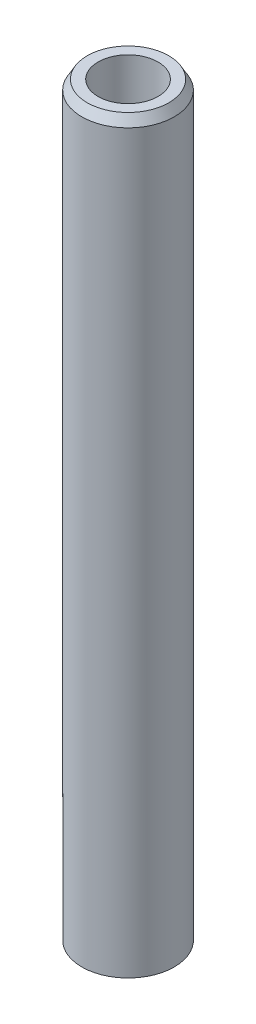
ISO-10303-21;
HEADER;
FILE_DESCRIPTION(('STEP AP214'),'2;1');
FILE_NAME('part.step','',(''),(''),'','','');
FILE_SCHEMA(('AUTOMOTIVE_DESIGN { 1 0 10303 214 1 1 1 1 }'));
ENDSEC;
DATA;
#1=APPLICATION_CONTEXT('core data for automotive mechanical design processes');
#2=APPLICATION_PROTOCOL_DEFINITION('international standard','automotive_design',2000,#1);
#3=PRODUCT_CONTEXT('',#1,'mechanical');
#4=PRODUCT('Part','Part','',(#3));
#5=PRODUCT_RELATED_PRODUCT_CATEGORY('part','',(#4));
#6=PRODUCT_DEFINITION_FORMATION('','',#4);
#7=PRODUCT_DEFINITION_CONTEXT('part definition',#1,'design');
#8=PRODUCT_DEFINITION('design','',#6,#7);
#9=PRODUCT_DEFINITION_SHAPE('','',#8);
#10=(LENGTH_UNIT() NAMED_UNIT(*) SI_UNIT(.MILLI.,.METRE.));
#11=(NAMED_UNIT(*) PLANE_ANGLE_UNIT() SI_UNIT($,.RADIAN.));
#12=(NAMED_UNIT(*) SI_UNIT($,.STERADIAN.) SOLID_ANGLE_UNIT());
#13=UNCERTAINTY_MEASURE_WITH_UNIT(LENGTH_MEASURE(1.E-05),#10,'distance_accuracy_value','');
#14=(GEOMETRIC_REPRESENTATION_CONTEXT(3) GLOBAL_UNCERTAINTY_ASSIGNED_CONTEXT((#13)) GLOBAL_UNIT_ASSIGNED_CONTEXT((#10,
#11,#12)) REPRESENTATION_CONTEXT('',''));
#15=CARTESIAN_POINT('',(0.,0.,0.));
#16=DIRECTION('',(0.,0.,1.));
#17=DIRECTION('',(1.,0.,0.));
#18=AXIS2_PLACEMENT_3D('',#15,#16,#17);
#19=CARTESIAN_POINT('',(0.,243.727219641702,0.));
#20=DIRECTION('',(0.,-1.,0.));
#21=DIRECTION('',(0.,0.,-1.));
#22=AXIS2_PLACEMENT_3D('',#19,#20,#21);
#23=CYLINDRICAL_SURFACE('',#22,15.);
#24=CARTESIAN_POINT('',(0.,240.657204855873,0.));
#25=DIRECTION('',(0.,1.,0.));
#26=DIRECTION('',(0.,0.,1.));
#27=AXIS2_PLACEMENT_3D('',#24,#25,#26);
#28=CIRCLE('',#27,15.);
#29=CARTESIAN_POINT('',(0.,240.657204855873,-15.));
#30=VERTEX_POINT('',#29);
#31=EDGE_CURVE('E50',#30,#30,#28,.F.);
#32=CARTESIAN_POINT('',(0.,1.7724738630143,0.));
#33=DIRECTION('',(0.,1.,0.));
#34=DIRECTION('',(0.,0.,1.));
#35=AXIS2_PLACEMENT_3D('',#32,#33,#34);
#36=CIRCLE('',#35,15.);
#37=CARTESIAN_POINT('',(0.,1.77247386301427,-15.));
#38=VERTEX_POINT('',#37);
#39=EDGE_CURVE('E51',#38,#38,#36,.T.);
#40=CARTESIAN_POINT('',(0.,240.657204855873,-15.));
#41=CARTESIAN_POINT('',(0.,238.168822241364,-15.));
#42=CARTESIAN_POINT('',(0.,235.680439626855,-15.));
#43=CARTESIAN_POINT('',(0.,230.703674397837,-15.));
#44=CARTESIAN_POINT('',(0.,228.215291783329,-15.));
#45=CARTESIAN_POINT('',(0.,223.238526554311,-15.));
#46=CARTESIAN_POINT('',(0.,220.750143939802,-15.));
#47=CARTESIAN_POINT('',(0.,215.773378710784,-15.));
#48=CARTESIAN_POINT('',(0.,213.284996096275,-15.));
#49=CARTESIAN_POINT('',(0.,208.308230867257,-15.));
#50=CARTESIAN_POINT('',(0.,205.819848252748,-15.));
#51=CARTESIAN_POINT('',(0.,200.84308302373,-15.));
#52=CARTESIAN_POINT('',(0.,198.354700409221,-15.));
#53=CARTESIAN_POINT('',(0.,193.377935180203,-15.));
#54=CARTESIAN_POINT('',(0.,190.889552565694,-15.));
#55=CARTESIAN_POINT('',(0.,185.912787336676,-15.));
#56=CARTESIAN_POINT('',(0.,183.424404722167,-15.));
#57=CARTESIAN_POINT('',(0.,178.44763949315,-15.));
#58=CARTESIAN_POINT('',(0.,175.959256878641,-15.));
#59=CARTESIAN_POINT('',(0.,170.982491649623,-15.));
#60=CARTESIAN_POINT('',(0.,168.494109035114,-15.));
#61=CARTESIAN_POINT('',(0.,163.517343806096,-15.));
#62=CARTESIAN_POINT('',(0.,161.028961191587,-15.));
#63=CARTESIAN_POINT('',(0.,156.052195962569,-15.));
#64=CARTESIAN_POINT('',(0.,153.56381334806,-15.));
#65=CARTESIAN_POINT('',(0.,148.587048119042,-15.));
#66=CARTESIAN_POINT('',(0.,146.098665504533,-15.));
#67=CARTESIAN_POINT('',(0.,141.121900275515,-15.));
#68=CARTESIAN_POINT('',(0.,138.633517661006,-15.));
#69=CARTESIAN_POINT('',(0.,133.656752431988,-15.));
#70=CARTESIAN_POINT('',(0.,131.16836981748,-15.));
#71=CARTESIAN_POINT('',(0.,126.191604588462,-15.));
#72=CARTESIAN_POINT('',(0.,123.703221973953,-15.));
#73=CARTESIAN_POINT('',(0.,118.726456744935,-15.));
#74=CARTESIAN_POINT('',(0.,116.238074130426,-15.));
#75=CARTESIAN_POINT('',(0.,111.261308901408,-15.));
#76=CARTESIAN_POINT('',(0.,108.772926286899,-15.));
#77=CARTESIAN_POINT('',(0.,103.796161057881,-15.));
#78=CARTESIAN_POINT('',(0.,101.307778443372,-15.));
#79=CARTESIAN_POINT('',(0.,96.3310132143543,-15.));
#80=CARTESIAN_POINT('',(0.,93.8426305998453,-15.));
#81=CARTESIAN_POINT('',(0.,88.8658653708274,-15.));
#82=CARTESIAN_POINT('',(0.,86.3774827563185,-15.));
#83=CARTESIAN_POINT('',(0.,81.4007175273006,-15.));
#84=CARTESIAN_POINT('',(0.,78.9123349127916,-15.));
#85=CARTESIAN_POINT('',(0.,73.9355696837737,-15.));
#86=CARTESIAN_POINT('',(0.,71.4471870692648,-15.));
#87=CARTESIAN_POINT('',(0.,66.4704218402469,-15.));
#88=CARTESIAN_POINT('',(0.,63.982039225738,-15.));
#89=CARTESIAN_POINT('',(0.,59.0052739967201,-15.));
#90=CARTESIAN_POINT('',(0.,56.5168913822111,-15.));
#91=CARTESIAN_POINT('',(0.,51.5401261531932,-15.));
#92=CARTESIAN_POINT('',(0.,49.0517435386843,-15.));
#93=CARTESIAN_POINT('',(0.,44.0749783096664,-15.));
#94=CARTESIAN_POINT('',(0.,41.5865956951574,-15.));
#95=CARTESIAN_POINT('',(0.,36.6098304661395,-15.));
#96=CARTESIAN_POINT('',(0.,34.1214478516306,-15.));
#97=CARTESIAN_POINT('',(0.,29.1446826226127,-15.));
#98=CARTESIAN_POINT('',(0.,26.6563000081038,-15.));
#99=CARTESIAN_POINT('',(0.,21.6795347790859,-15.));
#100=CARTESIAN_POINT('',(0.,19.1911521645769,-15.));
#101=CARTESIAN_POINT('',(0.,14.214386935559,-15.));
#102=CARTESIAN_POINT('',(0.,11.7260043210501,-15.));
#103=CARTESIAN_POINT('',(0.,6.74923909203216,-15.));
#104=CARTESIAN_POINT('',(0.,4.26085647752321,-15.));
#105=CARTESIAN_POINT('',(0.,1.77247386301427,-15.));
#106=B_SPLINE_CURVE_WITH_KNOTS('',3,(#40,#41,#42,#43,#44,#45,#46,#47,#48,#49,#50,#51,#52,#53,
#54,#55,#56,#57,#58,#59,#60,#61,#62,#63,#64,#65,#66,#67,#68,#69,#70,#71,#72,#73,#74,#75,#76,#77,
#78,#79,#80,#81,#82,#83,#84,#85,#86,#87,#88,#89,#90,#91,#92,#93,#94,#95,#96,#97,#98,#99,#100,
#101,#102,#103,#104,#105),.UNSPECIFIED.,.F.,.F.,(4,2,2,2,2,2,2,2,2,2,2,2,2,2,2,2,2,2,2,2,2,2,2,
2,2,2,2,2,2,2,2,2,4),(0.,7.46514784352684,14.9302956870537,22.3954435305805,29.8605913741073,
37.3257392176342,44.7908870611611,52.2560349046879,59.7211827482147,67.1863305917416,
74.6514784352684,82.1166262787953,89.5817741223221,97.0469219658489,104.512069809376,
111.977217652903,119.442365496429,126.907513339956,134.372661183483,141.83780902701,
149.302956870537,156.768104714064,164.233252557591,171.698400401117,179.163548244644,
186.628696088171,194.093843931698,201.558991775225,209.024139618752,216.489287462278,
223.954435305805,231.419583149332,238.884730992859),.UNSPECIFIED.);
#107=EDGE_CURVE('BSEAM39',#30,#38,#106,.T.);
#108=ORIENTED_EDGE('',*,*,#31,.T.);
#109=ORIENTED_EDGE('',*,*,#39,.T.);
#110=ORIENTED_EDGE('',*,*,#107,.T.);
#111=ORIENTED_EDGE('',*,*,#107,.F.);
#112=EDGE_LOOP('',(#108,#110,#109,#111));
#113=FACE_BOUND('',#112,.T.);
#114=ADVANCED_FACE('F39',(#113),#23,.T.);
#115=CARTESIAN_POINT('',(0.,243.727219641702,0.));
#116=DIRECTION('',(0.,1.,0.));
#117=DIRECTION('',(0.,0.,1.));
#118=AXIS2_PLACEMENT_3D('',#115,#116,#117);
#119=PLANE('',#118);
#120=CARTESIAN_POINT('',(0.,243.727219641702,0.));
#121=DIRECTION('',(0.,1.,0.));
#122=DIRECTION('',(0.,0.,1.));
#123=AXIS2_PLACEMENT_3D('',#120,#121,#122);
#124=CIRCLE('',#123,13.2275261369859);
#125=CARTESIAN_POINT('',(0.,243.727219641702,13.2275261369859));
#126=VERTEX_POINT('',#125);
#127=EDGE_CURVE('E54',#126,#126,#124,.T.);
#128=ORIENTED_EDGE('',*,*,#127,.T.);
#129=EDGE_LOOP('',(#128));
#130=FACE_BOUND('',#129,.T.);
#131=CARTESIAN_POINT('',(0.,243.727219641702,0.));
#132=DIRECTION('',(0.,1.,0.));
#133=DIRECTION('',(0.,0.,1.));
#134=AXIS2_PLACEMENT_3D('',#131,#132,#133);
#135=CIRCLE('',#134,9.72218142856205);
#136=CARTESIAN_POINT('',(0.,243.727219641702,-9.72218142856205));
#137=VERTEX_POINT('',#136);
#138=EDGE_CURVE('E58',#137,#137,#135,.T.);
#139=ORIENTED_EDGE('',*,*,#138,.F.);
#140=EDGE_LOOP('',(#139));
#141=FACE_BOUND('',#140,.T.);
#142=ADVANCED_FACE('F69',(#130,#141),#119,.T.);
#143=CARTESIAN_POINT('',(0.,0.,0.));
#144=DIRECTION('',(0.,1.,0.));
#145=DIRECTION('',(0.,0.,1.));
#146=AXIS2_PLACEMENT_3D('',#143,#144,#145);
#147=PLANE('',#146);
#148=CARTESIAN_POINT('',(0.,0.,0.));
#149=DIRECTION('',(0.,1.,0.));
#150=DIRECTION('',(0.,0.,1.));
#151=AXIS2_PLACEMENT_3D('',#148,#149,#150);
#152=CIRCLE('',#151,11.9299852141713);
#153=CARTESIAN_POINT('',(0.,0.,11.9299852141713));
#154=VERTEX_POINT('',#153);
#155=EDGE_CURVE('E10',#154,#154,#152,.F.);
#156=ORIENTED_EDGE('',*,*,#155,.T.);
#157=EDGE_LOOP('',(#156));
#158=FACE_BOUND('',#157,.T.);
#159=CARTESIAN_POINT('',(0.,0.,0.));
#160=DIRECTION('',(0.,1.,0.));
#161=DIRECTION('',(0.,0.,1.));
#162=AXIS2_PLACEMENT_3D('',#159,#160,#161);
#163=CIRCLE('',#162,9.72218142856205);
#164=CARTESIAN_POINT('',(0.,0.,-9.72218142856205));
#165=VERTEX_POINT('',#164);
#166=EDGE_CURVE('E63',#165,#165,#163,.T.);
#167=ORIENTED_EDGE('',*,*,#166,.T.);
#168=EDGE_LOOP('',(#167));
#169=FACE_BOUND('',#168,.T.);
#170=ADVANCED_FACE('F75',(#158,#169),#147,.F.);
#171=CARTESIAN_POINT('',(0.,243.727219641702,0.));
#172=DIRECTION('',(0.,-1.,0.));
#173=DIRECTION('',(0.,0.,-1.));
#174=AXIS2_PLACEMENT_3D('',#171,#172,#173);
#175=CYLINDRICAL_SURFACE('',#174,9.72218142856205);
#176=CARTESIAN_POINT('',(0.,243.727219641702,-9.72218142856205));
#177=CARTESIAN_POINT('',(0.,241.188394437101,-9.72218142856205));
#178=CARTESIAN_POINT('',(0.,238.649569232499,-9.72218142856205));
#179=CARTESIAN_POINT('',(0.,233.571918823297,-9.72218142856205));
#180=CARTESIAN_POINT('',(0.,231.033093618696,-9.72218142856205));
#181=CARTESIAN_POINT('',(0.,225.955443209494,-9.72218142856205));
#182=CARTESIAN_POINT('',(0.,223.416618004893,-9.72218142856205));
#183=CARTESIAN_POINT('',(0.,218.338967595691,-9.72218142856205));
#184=CARTESIAN_POINT('',(0.,215.80014239109,-9.72218142856205));
#185=CARTESIAN_POINT('',(0.,210.722491981888,-9.72218142856205));
#186=CARTESIAN_POINT('',(0.,208.183666777287,-9.72218142856205));
#187=CARTESIAN_POINT('',(0.,203.106016368085,-9.72218142856205));
#188=CARTESIAN_POINT('',(0.,200.567191163484,-9.72218142856205));
#189=CARTESIAN_POINT('',(0.,195.489540754281,-9.72218142856205));
#190=CARTESIAN_POINT('',(0.,192.95071554968,-9.72218142856205));
#191=CARTESIAN_POINT('',(0.,187.873065140478,-9.72218142856205));
#192=CARTESIAN_POINT('',(0.,185.334239935877,-9.72218142856205));
#193=CARTESIAN_POINT('',(0.,180.256589526675,-9.72218142856205));
#194=CARTESIAN_POINT('',(0.,177.717764322074,-9.72218142856205));
#195=CARTESIAN_POINT('',(0.,172.640113912872,-9.72218142856205));
#196=CARTESIAN_POINT('',(0.,170.101288708271,-9.72218142856205));
#197=CARTESIAN_POINT('',(0.,165.023638299069,-9.72218142856205));
#198=CARTESIAN_POINT('',(0.,162.484813094468,-9.72218142856205));
#199=CARTESIAN_POINT('',(0.,157.407162685266,-9.72218142856205));
#200=CARTESIAN_POINT('',(0.,154.868337480665,-9.72218142856205));
#201=CARTESIAN_POINT('',(0.,149.790687071462,-9.72218142856205));
#202=CARTESIAN_POINT('',(0.,147.251861866861,-9.72218142856205));
#203=CARTESIAN_POINT('',(0.,142.174211457659,-9.72218142856205));
#204=CARTESIAN_POINT('',(0.,139.635386253058,-9.72218142856205));
#205=CARTESIAN_POINT('',(0.,134.557735843856,-9.72218142856205));
#206=CARTESIAN_POINT('',(0.,132.018910639255,-9.72218142856205));
#207=CARTESIAN_POINT('',(0.,126.941260230053,-9.72218142856205));
#208=CARTESIAN_POINT('',(0.,124.402435025452,-9.72218142856205));
#209=CARTESIAN_POINT('',(0.,119.32478461625,-9.72218142856205));
#210=CARTESIAN_POINT('',(0.,116.785959411649,-9.72218142856205));
#211=CARTESIAN_POINT('',(0.,111.708309002447,-9.72218142856205));
#212=CARTESIAN_POINT('',(0.,109.169483797846,-9.72218142856205));
#213=CARTESIAN_POINT('',(0.,104.091833388643,-9.72218142856205));
#214=CARTESIAN_POINT('',(0.,101.553008184042,-9.72218142856205));
#215=CARTESIAN_POINT('',(0.,96.4753577748402,-9.72218142856205));
#216=CARTESIAN_POINT('',(0.,93.9365325702392,-9.72218142856205));
#217=CARTESIAN_POINT('',(0.,88.858882161037,-9.72218142856205));
#218=CARTESIAN_POINT('',(0.,86.320056956436,-9.72218142856205));
#219=CARTESIAN_POINT('',(0.,81.2424065472339,-9.72218142856205));
#220=CARTESIAN_POINT('',(0.,78.7035813426328,-9.72218142856205));
#221=CARTESIAN_POINT('',(0.,73.6259309334307,-9.72218142856205));
#222=CARTESIAN_POINT('',(0.,71.0871057288296,-9.72218142856205));
#223=CARTESIAN_POINT('',(0.,66.0094553196275,-9.72218142856205));
#224=CARTESIAN_POINT('',(0.,63.4706301150265,-9.72218142856205));
#225=CARTESIAN_POINT('',(0.,58.3929797058243,-9.72218142856205));
#226=CARTESIAN_POINT('',(0.,55.8541545012233,-9.72218142856205));
#227=CARTESIAN_POINT('',(0.,50.7765040920212,-9.72218142856205));
#228=CARTESIAN_POINT('',(0.,48.2376788874201,-9.72218142856205));
#229=CARTESIAN_POINT('',(0.,43.160028478218,-9.72218142856205));
#230=CARTESIAN_POINT('',(0.,40.6212032736169,-9.72218142856205));
#231=CARTESIAN_POINT('',(0.,35.5435528644148,-9.72218142856205));
#232=CARTESIAN_POINT('',(0.,33.0047276598138,-9.72218142856205));
#233=CARTESIAN_POINT('',(0.,27.9270772506116,-9.72218142856205));
#234=CARTESIAN_POINT('',(0.,25.3882520460106,-9.72218142856205));
#235=CARTESIAN_POINT('',(0.,20.3106016368085,-9.72218142856205));
#236=CARTESIAN_POINT('',(0.,17.7717764322074,-9.72218142856205));
#237=CARTESIAN_POINT('',(0.,12.6941260230053,-9.72218142856205));
#238=CARTESIAN_POINT('',(0.,10.1553008184042,-9.72218142856205));
#239=CARTESIAN_POINT('',(0.,5.07765040920212,-9.72218142856205));
#240=CARTESIAN_POINT('',(0.,2.53882520460106,-9.72218142856205));
#241=CARTESIAN_POINT('',(0.,0.,-9.72218142856205));
#242=B_SPLINE_CURVE_WITH_KNOTS('',3,(#176,#177,#178,#179,#180,#181,#182,#183,#184,#185,#186,
#187,#188,#189,#190,#191,#192,#193,#194,#195,#196,#197,#198,#199,#200,#201,#202,#203,#204,#205,
#206,#207,#208,#209,#210,#211,#212,#213,#214,#215,#216,#217,#218,#219,#220,#221,#222,#223,#224,
#225,#226,#227,#228,#229,#230,#231,#232,#233,#234,#235,#236,#237,#238,#239,#240,#241),
.UNSPECIFIED.,.F.,.F.,(4,2,2,2,2,2,2,2,2,2,2,2,2,2,2,2,2,2,2,2,2,2,2,2,2,2,2,2,2,2,2,2,4),(0.,
7.61647561380316,15.2329512276063,22.8494268414095,30.4659024552127,38.0823780690158,
45.698853682819,53.3153292966222,60.9318049104254,68.5482805242286,76.1647561380317,
83.7812317518349,91.3977073656381,99.0141829794413,106.630658593244,114.247134207048,
121.863609820851,129.480085434654,137.096561048457,144.71303666226,152.329512276063,
159.945987889867,167.56246350367,175.178939117473,182.795414731276,190.411890345079,
198.028365958883,205.644841572686,213.261317186489,220.877792800292,228.494268414095,
236.110744027898,243.727219641702),.UNSPECIFIED.);
#243=EDGE_CURVE('BSEAM70',#137,#165,#242,.T.);
#244=ORIENTED_EDGE('',*,*,#138,.T.);
#245=ORIENTED_EDGE('',*,*,#166,.F.);
#246=ORIENTED_EDGE('',*,*,#243,.T.);
#247=ORIENTED_EDGE('',*,*,#243,.F.);
#248=EDGE_LOOP('',(#244,#246,#245,#247));
#249=FACE_BOUND('',#248,.T.);
#250=ADVANCED_FACE('F70',(#249),#175,.F.);
#251=CARTESIAN_POINT('',(0.,243.727219641702,0.));
#252=DIRECTION('',(0.,-1.,0.));
#253=DIRECTION('',(0.,0.,-1.));
#254=AXIS2_PLACEMENT_3D('',#251,#252,#253);
#255=CONICAL_SURFACE('',#254,13.2275261369859,0.523598775598292);
#256=ORIENTED_EDGE('',*,*,#31,.F.);
#257=EDGE_LOOP('',(#256));
#258=FACE_BOUND('',#257,.T.);
#259=ORIENTED_EDGE('',*,*,#127,.F.);
#260=EDGE_LOOP('',(#259));
#261=FACE_BOUND('',#260,.T.);
#262=ADVANCED_FACE('F81',(#258,#261),#255,.T.);
#263=CARTESIAN_POINT('',(0.,1.7724738630143,0.));
#264=DIRECTION('',(0.,1.,0.));
#265=DIRECTION('',(0.,0.,1.));
#266=AXIS2_PLACEMENT_3D('',#263,#264,#265);
#267=CONICAL_SURFACE('',#266,15.,1.04719755119661);
#268=ORIENTED_EDGE('',*,*,#155,.F.);
#269=EDGE_LOOP('',(#268));
#270=FACE_BOUND('',#269,.T.);
#271=ORIENTED_EDGE('',*,*,#39,.F.);
#272=EDGE_LOOP('',(#271));
#273=FACE_BOUND('',#272,.T.);
#274=ADVANCED_FACE('F45',(#270,#273),#267,.T.);
#275=CLOSED_SHELL('',(#114,#142,#170,#250,#262,#274));
#276=MANIFOLD_SOLID_BREP('B2',#275);
#277=ADVANCED_BREP_SHAPE_REPRESENTATION('',(#18,#276),#14);
#278=SHAPE_DEFINITION_REPRESENTATION(#9,#277);
ENDSEC;
END-ISO-10303-21;
